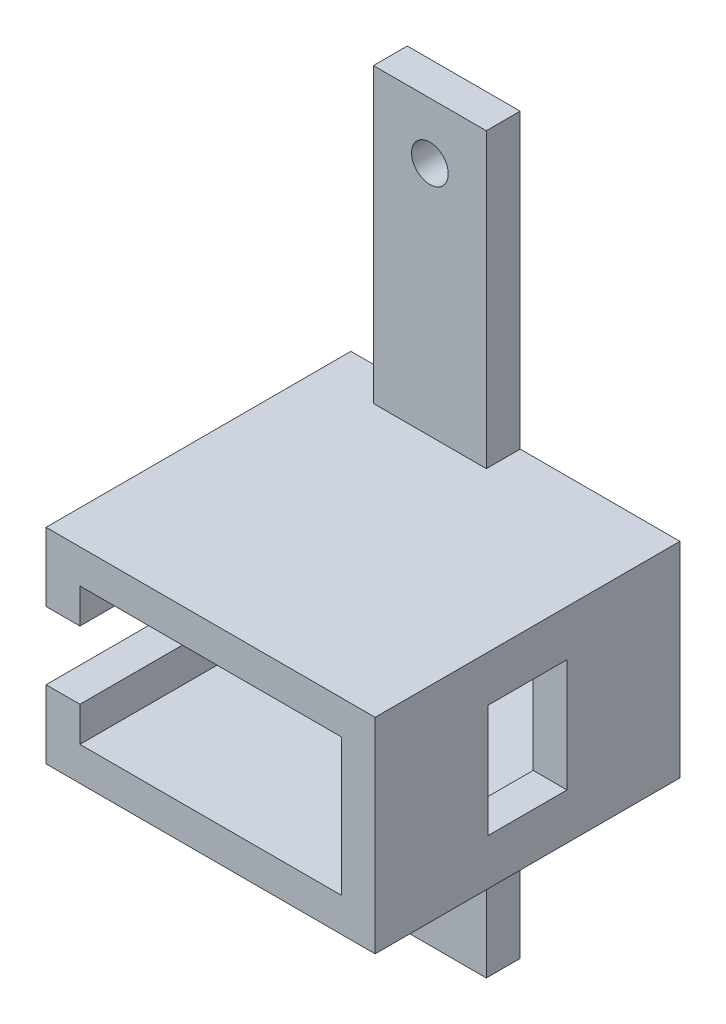
ISO-10303-21;
HEADER;
FILE_DESCRIPTION(('STEP AP214'),'2;1');
FILE_NAME('part.step','',(''),(''),'','','');
FILE_SCHEMA(('AUTOMOTIVE_DESIGN { 1 0 10303 214 1 1 1 1 }'));
ENDSEC;
DATA;
#1=APPLICATION_CONTEXT('core data for automotive mechanical design processes');
#2=APPLICATION_PROTOCOL_DEFINITION('international standard','automotive_design',2000,#1);
#3=PRODUCT_CONTEXT('',#1,'mechanical');
#4=PRODUCT('Part','Part','',(#3));
#5=PRODUCT_RELATED_PRODUCT_CATEGORY('part','',(#4));
#6=PRODUCT_DEFINITION_FORMATION('','',#4);
#7=PRODUCT_DEFINITION_CONTEXT('part definition',#1,'design');
#8=PRODUCT_DEFINITION('design','',#6,#7);
#9=PRODUCT_DEFINITION_SHAPE('','',#8);
#10=(LENGTH_UNIT() NAMED_UNIT(*) SI_UNIT(.MILLI.,.METRE.));
#11=(NAMED_UNIT(*) PLANE_ANGLE_UNIT() SI_UNIT($,.RADIAN.));
#12=(NAMED_UNIT(*) SI_UNIT($,.STERADIAN.) SOLID_ANGLE_UNIT());
#13=UNCERTAINTY_MEASURE_WITH_UNIT(LENGTH_MEASURE(1.E-05),#10,'distance_accuracy_value','');
#14=(GEOMETRIC_REPRESENTATION_CONTEXT(3) GLOBAL_UNCERTAINTY_ASSIGNED_CONTEXT((#13)) GLOBAL_UNIT_ASSIGNED_CONTEXT((#10,
#11,#12)) REPRESENTATION_CONTEXT('',''));
#15=CARTESIAN_POINT('',(0.,0.,0.));
#16=DIRECTION('',(0.,0.,1.));
#17=DIRECTION('',(1.,0.,0.));
#18=AXIS2_PLACEMENT_3D('',#15,#16,#17);
#19=CARTESIAN_POINT('',(-2.,0.,27.));
#20=DIRECTION('',(1.,0.,0.));
#21=DIRECTION('',(0.,1.,0.));
#22=AXIS2_PLACEMENT_3D('',#19,#20,#21);
#23=PLANE('',#22);
#24=DIRECTION('',(0.,0.,1.));
#25=VECTOR('',#24,1.);
#26=CARTESIAN_POINT('',(-2.,-32.,27.));
#27=LINE('',#26,#25);
#28=CARTESIAN_POINT('',(-2.,-32.,0.));
#29=VERTEX_POINT('',#28);
#30=CARTESIAN_POINT('',(-2.,-32.,27.));
#31=VERTEX_POINT('',#30);
#32=EDGE_CURVE('E233',#29,#31,#27,.T.);
#33=ORIENTED_EDGE('',*,*,#32,.F.);
#34=DIRECTION('',(0.,-1.,0.));
#35=VECTOR('',#34,1.);
#36=CARTESIAN_POINT('',(-2.,0.,0.));
#37=LINE('',#36,#35);
#38=CARTESIAN_POINT('',(-2.,-28.925,0.));
#39=VERTEX_POINT('',#38);
#40=EDGE_CURVE('E317',#39,#29,#37,.T.);
#41=ORIENTED_EDGE('',*,*,#40,.F.);
#42=DIRECTION('',(0.,0.,-1.));
#43=VECTOR('',#42,1.);
#44=CARTESIAN_POINT('',(-2.,-28.925,27.));
#45=LINE('',#44,#43);
#46=CARTESIAN_POINT('',(-2.,-28.925,27.));
#47=VERTEX_POINT('',#46);
#48=EDGE_CURVE('E337',#47,#39,#45,.T.);
#49=ORIENTED_EDGE('',*,*,#48,.F.);
#50=DIRECTION('',(0.,-1.,0.));
#51=VECTOR('',#50,1.);
#52=CARTESIAN_POINT('',(-2.,0.,27.));
#53=LINE('',#52,#51);
#54=EDGE_CURVE('E289',#47,#31,#53,.T.);
#55=ORIENTED_EDGE('',*,*,#54,.T.);
#56=EDGE_LOOP('',(#33,#41,#49,#55));
#57=FACE_BOUND('',#56,.T.);
#58=ADVANCED_FACE('F35',(#57),#23,.T.);
#59=CARTESIAN_POINT('',(-5.,0.,27.));
#60=DIRECTION('',(1.,0.,0.));
#61=DIRECTION('',(0.,1.,0.));
#62=AXIS2_PLACEMENT_3D('',#59,#60,#61);
#63=PLANE('',#62);
#64=DIRECTION('',(0.,-1.,0.));
#65=VECTOR('',#64,1.);
#66=CARTESIAN_POINT('',(-5.,0.,0.));
#67=LINE('',#66,#65);
#68=CARTESIAN_POINT('',(-4.99999999999999,-25.925,0.));
#69=VERTEX_POINT('',#68);
#70=CARTESIAN_POINT('',(-4.99999999999999,-32.,0.));
#71=VERTEX_POINT('',#70);
#72=EDGE_CURVE('E313',#69,#71,#67,.T.);
#73=ORIENTED_EDGE('',*,*,#72,.T.);
#74=DIRECTION('',(0.,0.,-1.));
#75=VECTOR('',#74,1.);
#76=CARTESIAN_POINT('',(-4.99999999999999,-32.,0.));
#77=LINE('',#76,#75);
#78=CARTESIAN_POINT('',(-4.99999999999999,-32.,27.));
#79=VERTEX_POINT('',#78);
#80=EDGE_CURVE('E224',#79,#71,#77,.T.);
#81=ORIENTED_EDGE('',*,*,#80,.F.);
#82=DIRECTION('',(0.,-1.,0.));
#83=VECTOR('',#82,1.);
#84=CARTESIAN_POINT('',(-5.,0.,27.));
#85=LINE('',#84,#83);
#86=CARTESIAN_POINT('',(-4.99999999999999,-25.925,27.));
#87=VERTEX_POINT('',#86);
#88=EDGE_CURVE('E285',#87,#79,#85,.T.);
#89=ORIENTED_EDGE('',*,*,#88,.F.);
#90=DIRECTION('',(0.,0.,-1.));
#91=VECTOR('',#90,1.);
#92=CARTESIAN_POINT('',(-4.99999999999999,-25.925,27.));
#93=LINE('',#92,#91);
#94=EDGE_CURVE('E342',#87,#69,#93,.T.);
#95=ORIENTED_EDGE('',*,*,#94,.T.);
#96=EDGE_LOOP('',(#73,#81,#89,#95));
#97=FACE_BOUND('',#96,.T.);
#98=ADVANCED_FACE('F419',(#97),#63,.F.);
#99=CARTESIAN_POINT('',(0.,0.,3.));
#100=DIRECTION('',(1.,0.,0.));
#101=DIRECTION('',(0.,1.,0.));
#102=AXIS2_PLACEMENT_3D('',#99,#100,#101);
#103=PLANE('',#102);
#104=DIRECTION('',(0.,-1.,0.));
#105=VECTOR('',#104,1.);
#106=CARTESIAN_POINT('',(0.,0.,0.));
#107=LINE('',#106,#105);
#108=CARTESIAN_POINT('',(0.,0.,0.));
#109=VERTEX_POINT('',#108);
#110=CARTESIAN_POINT('',(0.,-25.925,0.));
#111=VERTEX_POINT('',#110);
#112=EDGE_CURVE('E339',#109,#111,#107,.T.);
#113=ORIENTED_EDGE('',*,*,#112,.T.);
#114=DIRECTION('',(0.,0.,-1.));
#115=VECTOR('',#114,1.);
#116=CARTESIAN_POINT('',(0.,-25.925,3.));
#117=LINE('',#116,#115);
#118=CARTESIAN_POINT('',(0.,-25.925,3.));
#119=VERTEX_POINT('',#118);
#120=EDGE_CURVE('E371',#119,#111,#117,.T.);
#121=ORIENTED_EDGE('',*,*,#120,.F.);
#122=DIRECTION('',(0.,-1.,0.));
#123=VECTOR('',#122,1.);
#124=CARTESIAN_POINT('',(0.,0.,3.));
#125=LINE('',#124,#123);
#126=CARTESIAN_POINT('',(0.,0.,3.));
#127=VERTEX_POINT('',#126);
#128=EDGE_CURVE('E348',#127,#119,#125,.T.);
#129=ORIENTED_EDGE('',*,*,#128,.F.);
#130=DIRECTION('',(0.,0.,-1.));
#131=VECTOR('',#130,1.);
#132=CARTESIAN_POINT('',(0.,0.,3.));
#133=LINE('',#132,#131);
#134=EDGE_CURVE('E359',#127,#109,#133,.T.);
#135=ORIENTED_EDGE('',*,*,#134,.T.);
#136=EDGE_LOOP('',(#113,#121,#129,#135));
#137=FACE_BOUND('',#136,.T.);
#138=ADVANCED_FACE('F37',(#137),#103,.F.);
#139=CARTESIAN_POINT('',(10.,0.,3.));
#140=DIRECTION('',(1.,0.,0.));
#141=DIRECTION('',(0.,1.,0.));
#142=AXIS2_PLACEMENT_3D('',#139,#140,#141);
#143=PLANE('',#142);
#144=DIRECTION('',(0.,-1.,0.));
#145=VECTOR('',#144,1.);
#146=CARTESIAN_POINT('',(10.,0.,0.));
#147=LINE('',#146,#145);
#148=CARTESIAN_POINT('',(10.,0.,0.));
#149=VERTEX_POINT('',#148);
#150=CARTESIAN_POINT('',(10.,-25.925,0.));
#151=VERTEX_POINT('',#150);
#152=EDGE_CURVE('E361',#149,#151,#147,.T.);
#153=ORIENTED_EDGE('',*,*,#152,.F.);
#154=DIRECTION('',(0.,0.,-1.));
#155=VECTOR('',#154,1.);
#156=CARTESIAN_POINT('',(10.,0.,3.));
#157=LINE('',#156,#155);
#158=CARTESIAN_POINT('',(10.,0.,3.));
#159=VERTEX_POINT('',#158);
#160=EDGE_CURVE('E367',#159,#149,#157,.T.);
#161=ORIENTED_EDGE('',*,*,#160,.F.);
#162=DIRECTION('',(0.,-1.,0.));
#163=VECTOR('',#162,1.);
#164=CARTESIAN_POINT('',(10.,0.,3.));
#165=LINE('',#164,#163);
#166=CARTESIAN_POINT('',(10.,-25.925,3.));
#167=VERTEX_POINT('',#166);
#168=EDGE_CURVE('E353',#159,#167,#165,.T.);
#169=ORIENTED_EDGE('',*,*,#168,.T.);
#170=DIRECTION('',(0.,0.,-1.));
#171=VECTOR('',#170,1.);
#172=CARTESIAN_POINT('',(10.,-25.925,3.));
#173=LINE('',#172,#171);
#174=EDGE_CURVE('E369',#167,#151,#173,.T.);
#175=ORIENTED_EDGE('',*,*,#174,.T.);
#176=EDGE_LOOP('',(#153,#161,#169,#175));
#177=FACE_BOUND('',#176,.T.);
#178=ADVANCED_FACE('F461',(#177),#143,.T.);
#179=CARTESIAN_POINT('',(0.,0.,3.));
#180=DIRECTION('',(0.,1.,0.));
#181=DIRECTION('',(0.,0.,1.));
#182=AXIS2_PLACEMENT_3D('',#179,#180,#181);
#183=PLANE('',#182);
#184=DIRECTION('',(1.,0.,0.));
#185=VECTOR('',#184,1.);
#186=CARTESIAN_POINT('',(0.,0.,0.));
#187=LINE('',#186,#185);
#188=EDGE_CURVE('E351',#109,#149,#187,.T.);
#189=ORIENTED_EDGE('',*,*,#188,.F.);
#190=ORIENTED_EDGE('',*,*,#134,.F.);
#191=DIRECTION('',(1.,0.,0.));
#192=VECTOR('',#191,1.);
#193=CARTESIAN_POINT('',(0.,0.,3.));
#194=LINE('',#193,#192);
#195=EDGE_CURVE('E356',#127,#159,#194,.T.);
#196=ORIENTED_EDGE('',*,*,#195,.T.);
#197=ORIENTED_EDGE('',*,*,#160,.T.);
#198=EDGE_LOOP('',(#189,#190,#196,#197));
#199=FACE_BOUND('',#198,.T.);
#200=ADVANCED_FACE('F455',(#199),#183,.T.);
#201=CARTESIAN_POINT('',(0.,0.,3.));
#202=DIRECTION('',(0.,0.,1.));
#203=DIRECTION('',(1.,0.,0.));
#204=AXIS2_PLACEMENT_3D('',#201,#202,#203);
#205=PLANE('',#204);
#206=CARTESIAN_POINT('',(5.,-5.,3.));
#207=DIRECTION('',(0.,0.,1.));
#208=DIRECTION('',(1.,0.,0.));
#209=AXIS2_PLACEMENT_3D('',#206,#207,#208);
#210=CIRCLE('',#209,1.625);
#211=CARTESIAN_POINT('',(6.625,-5.,3.));
#212=VERTEX_POINT('',#211);
#213=EDGE_CURVE('E239',#212,#212,#210,.T.);
#214=ORIENTED_EDGE('',*,*,#213,.F.);
#215=EDGE_LOOP('',(#214));
#216=FACE_BOUND('',#215,.T.);
#217=ORIENTED_EDGE('',*,*,#128,.T.);
#218=DIRECTION('',(1.,0.,0.));
#219=VECTOR('',#218,1.);
#220=CARTESIAN_POINT('',(0.,-25.925,3.));
#221=LINE('',#220,#219);
#222=EDGE_CURVE('E350',#119,#167,#221,.T.);
#223=ORIENTED_EDGE('',*,*,#222,.T.);
#224=ORIENTED_EDGE('',*,*,#168,.F.);
#225=ORIENTED_EDGE('',*,*,#195,.F.);
#226=EDGE_LOOP('',(#217,#223,#224,#225));
#227=FACE_BOUND('',#226,.T.);
#228=ADVANCED_FACE('F449',(#216,#227),#205,.T.);
#229=CARTESIAN_POINT('',(0.,0.,0.));
#230=DIRECTION('',(0.,0.,1.));
#231=DIRECTION('',(1.,0.,0.));
#232=AXIS2_PLACEMENT_3D('',#229,#230,#231);
#233=PLANE('',#232);
#234=CARTESIAN_POINT('',(5.00000000000001,-60.,0.));
#235=DIRECTION('',(0.,0.,1.));
#236=DIRECTION('',(1.,0.,0.));
#237=AXIS2_PLACEMENT_3D('',#234,#235,#236);
#238=CIRCLE('',#237,1.625);
#239=CARTESIAN_POINT('',(6.62500000000001,-60.,0.));
#240=VERTEX_POINT('',#239);
#241=EDGE_CURVE('E236',#240,#240,#238,.T.);
#242=ORIENTED_EDGE('',*,*,#241,.T.);
#243=EDGE_LOOP('',(#242));
#244=FACE_BOUND('',#243,.T.);
#245=CARTESIAN_POINT('',(5.,-5.,0.));
#246=DIRECTION('',(0.,0.,1.));
#247=DIRECTION('',(1.,0.,0.));
#248=AXIS2_PLACEMENT_3D('',#245,#246,#247);
#249=CIRCLE('',#248,1.625);
#250=CARTESIAN_POINT('',(6.625,-5.,0.));
#251=VERTEX_POINT('',#250);
#252=EDGE_CURVE('E242',#251,#251,#249,.T.);
#253=ORIENTED_EDGE('',*,*,#252,.T.);
#254=EDGE_LOOP('',(#253));
#255=FACE_BOUND('',#254,.T.);
#256=ORIENTED_EDGE('',*,*,#40,.T.);
#257=DIRECTION('',(-1.,0.,0.));
#258=VECTOR('',#257,1.);
#259=CARTESIAN_POINT('',(5.00000000000001,-32.,0.));
#260=LINE('',#259,#258);
#261=EDGE_CURVE('E227',#29,#71,#260,.T.);
#262=ORIENTED_EDGE('',*,*,#261,.T.);
#263=ORIENTED_EDGE('',*,*,#72,.F.);
#264=DIRECTION('',(-1.,0.,0.));
#265=VECTOR('',#264,1.);
#266=CARTESIAN_POINT('',(0.,-25.925,0.));
#267=LINE('',#266,#265);
#268=EDGE_CURVE('E308',#111,#69,#267,.T.);
#269=ORIENTED_EDGE('',*,*,#268,.F.);
#270=ORIENTED_EDGE('',*,*,#112,.F.);
#271=ORIENTED_EDGE('',*,*,#188,.T.);
#272=ORIENTED_EDGE('',*,*,#152,.T.);
#273=CARTESIAN_POINT('',(24.15,-25.925,0.));
#274=VERTEX_POINT('',#273);
#275=EDGE_CURVE('E309',#274,#151,#267,.T.);
#276=ORIENTED_EDGE('',*,*,#275,.F.);
#277=DIRECTION('',(0.,-1.,0.));
#278=VECTOR('',#277,1.);
#279=CARTESIAN_POINT('',(24.15,0.,0.));
#280=LINE('',#279,#278);
#281=CARTESIAN_POINT('',(24.15,-44.075,0.));
#282=VERTEX_POINT('',#281);
#283=EDGE_CURVE('E305',#274,#282,#280,.T.);
#284=ORIENTED_EDGE('',*,*,#283,.T.);
#285=DIRECTION('',(-1.,0.,0.));
#286=VECTOR('',#285,1.);
#287=CARTESIAN_POINT('',(0.,-44.075,0.));
#288=LINE('',#287,#286);
#289=CARTESIAN_POINT('',(10.,-44.075,0.));
#290=VERTEX_POINT('',#289);
#291=EDGE_CURVE('E302',#282,#290,#288,.T.);
#292=ORIENTED_EDGE('',*,*,#291,.T.);
#293=DIRECTION('',(0.,-1.,0.));
#294=VECTOR('',#293,1.);
#295=CARTESIAN_POINT('',(10.,0.,0.));
#296=LINE('',#295,#294);
#297=CARTESIAN_POINT('',(10.,-65.,0.));
#298=VERTEX_POINT('',#297);
#299=EDGE_CURVE('E245',#290,#298,#296,.T.);
#300=ORIENTED_EDGE('',*,*,#299,.T.);
#301=DIRECTION('',(1.,0.,0.));
#302=VECTOR('',#301,1.);
#303=CARTESIAN_POINT('',(0.,-65.,0.));
#304=LINE('',#303,#302);
#305=CARTESIAN_POINT('',(0.,-65.,0.));
#306=VERTEX_POINT('',#305);
#307=EDGE_CURVE('E252',#306,#298,#304,.T.);
#308=ORIENTED_EDGE('',*,*,#307,.F.);
#309=DIRECTION('',(0.,-1.,0.));
#310=VECTOR('',#309,1.);
#311=CARTESIAN_POINT('',(0.,0.,0.));
#312=LINE('',#311,#310);
#313=CARTESIAN_POINT('',(0.,-44.075,0.));
#314=VERTEX_POINT('',#313);
#315=EDGE_CURVE('E261',#314,#306,#312,.T.);
#316=ORIENTED_EDGE('',*,*,#315,.F.);
#317=CARTESIAN_POINT('',(-4.99999999999999,-44.075,0.));
#318=VERTEX_POINT('',#317);
#319=EDGE_CURVE('E274',#314,#318,#288,.T.);
#320=ORIENTED_EDGE('',*,*,#319,.T.);
#321=CARTESIAN_POINT('',(-4.99999999999999,-38.,0.));
#322=VERTEX_POINT('',#321);
#323=EDGE_CURVE('E312',#322,#318,#67,.T.);
#324=ORIENTED_EDGE('',*,*,#323,.F.);
#325=DIRECTION('',(-1.,0.,0.));
#326=VECTOR('',#325,1.);
#327=CARTESIAN_POINT('',(5.00000000000001,-38.,0.));
#328=LINE('',#327,#326);
#329=CARTESIAN_POINT('',(-1.99999999999999,-38.,0.));
#330=VERTEX_POINT('',#329);
#331=EDGE_CURVE('E226',#330,#322,#328,.T.);
#332=ORIENTED_EDGE('',*,*,#331,.F.);
#333=CARTESIAN_POINT('',(-1.99999999999999,-41.075,0.));
#334=VERTEX_POINT('',#333);
#335=EDGE_CURVE('E316',#330,#334,#37,.T.);
#336=ORIENTED_EDGE('',*,*,#335,.T.);
#337=DIRECTION('',(-1.,0.,0.));
#338=VECTOR('',#337,1.);
#339=CARTESIAN_POINT('',(0.,-41.075,0.));
#340=LINE('',#339,#338);
#341=CARTESIAN_POINT('',(21.15,-41.075,0.));
#342=VERTEX_POINT('',#341);
#343=EDGE_CURVE('E279',#342,#334,#340,.T.);
#344=ORIENTED_EDGE('',*,*,#343,.F.);
#345=DIRECTION('',(0.,-1.,0.));
#346=VECTOR('',#345,1.);
#347=CARTESIAN_POINT('',(21.15,0.,0.));
#348=LINE('',#347,#346);
#349=CARTESIAN_POINT('',(21.15,-28.925,0.));
#350=VERTEX_POINT('',#349);
#351=EDGE_CURVE('E323',#350,#342,#348,.T.);
#352=ORIENTED_EDGE('',*,*,#351,.F.);
#353=DIRECTION('',(-1.,0.,0.));
#354=VECTOR('',#353,1.);
#355=CARTESIAN_POINT('',(0.,-28.925,0.));
#356=LINE('',#355,#354);
#357=EDGE_CURVE('E320',#350,#39,#356,.T.);
#358=ORIENTED_EDGE('',*,*,#357,.T.);
#359=EDGE_LOOP('',(#256,#262,#263,#269,#270,#271,#272,#276,#284,#292,#300,#308,#316,#320,#324,
#332,#336,#344,#352,#358));
#360=FACE_BOUND('',#359,.T.);
#361=ADVANCED_FACE('F395',(#244,#255,#360),#233,.F.);
#362=DIRECTION('',(0.,0.,-1.));
#363=VECTOR('',#362,1.);
#364=CARTESIAN_POINT('',(-1.99999999999999,-38.,27.));
#365=LINE('',#364,#363);
#366=CARTESIAN_POINT('',(-1.99999999999999,-38.,27.));
#367=VERTEX_POINT('',#366);
#368=EDGE_CURVE('E230',#367,#330,#365,.T.);
#369=ORIENTED_EDGE('',*,*,#368,.F.);
#370=CARTESIAN_POINT('',(-1.99999999999999,-41.075,27.));
#371=VERTEX_POINT('',#370);
#372=EDGE_CURVE('E288',#367,#371,#53,.T.);
#373=ORIENTED_EDGE('',*,*,#372,.T.);
#374=DIRECTION('',(0.,0.,-1.));
#375=VECTOR('',#374,1.);
#376=CARTESIAN_POINT('',(-1.99999999999999,-41.075,27.));
#377=LINE('',#376,#375);
#378=EDGE_CURVE('E328',#371,#334,#377,.T.);
#379=ORIENTED_EDGE('',*,*,#378,.T.);
#380=ORIENTED_EDGE('',*,*,#335,.F.);
#381=EDGE_LOOP('',(#369,#373,#379,#380));
#382=FACE_BOUND('',#381,.T.);
#383=ADVANCED_FACE('F384',(#382),#23,.T.);
#384=CARTESIAN_POINT('',(0.,-28.925,27.));
#385=DIRECTION('',(0.,-1.,0.));
#386=DIRECTION('',(1.,0.,0.));
#387=AXIS2_PLACEMENT_3D('',#384,#385,#386);
#388=PLANE('',#387);
#389=ORIENTED_EDGE('',*,*,#357,.F.);
#390=DIRECTION('',(0.,0.,-1.));
#391=VECTOR('',#390,1.);
#392=CARTESIAN_POINT('',(21.15,-28.925,27.));
#393=LINE('',#392,#391);
#394=CARTESIAN_POINT('',(21.15,-28.925,27.));
#395=VERTEX_POINT('',#394);
#396=EDGE_CURVE('E335',#395,#350,#393,.T.);
#397=ORIENTED_EDGE('',*,*,#396,.F.);
#398=DIRECTION('',(-1.,0.,0.));
#399=VECTOR('',#398,1.);
#400=CARTESIAN_POINT('',(0.,-28.925,27.));
#401=LINE('',#400,#399);
#402=EDGE_CURVE('E292',#395,#47,#401,.T.);
#403=ORIENTED_EDGE('',*,*,#402,.T.);
#404=ORIENTED_EDGE('',*,*,#48,.T.);
#405=EDGE_LOOP('',(#389,#397,#403,#404));
#406=FACE_BOUND('',#405,.T.);
#407=ADVANCED_FACE('F428',(#406),#388,.T.);
#408=CARTESIAN_POINT('',(21.15,0.,27.));
#409=DIRECTION('',(1.,0.,0.));
#410=DIRECTION('',(0.,1.,0.));
#411=AXIS2_PLACEMENT_3D('',#408,#409,#410);
#412=PLANE('',#411);
#413=DIRECTION('',(0.,0.,-1.));
#414=VECTOR('',#413,1.);
#415=CARTESIAN_POINT('',(21.15,-30.,17.));
#416=LINE('',#415,#414);
#417=CARTESIAN_POINT('',(21.15,-30.,17.));
#418=VERTEX_POINT('',#417);
#419=CARTESIAN_POINT('',(21.15,-30.,10.));
#420=VERTEX_POINT('',#419);
#421=EDGE_CURVE('E199',#418,#420,#416,.T.);
#422=ORIENTED_EDGE('',*,*,#421,.F.);
#423=DIRECTION('',(0.,1.,0.));
#424=VECTOR('',#423,1.);
#425=CARTESIAN_POINT('',(21.15,-30.,17.));
#426=LINE('',#425,#424);
#427=CARTESIAN_POINT('',(21.15,-40.,17.));
#428=VERTEX_POINT('',#427);
#429=EDGE_CURVE('E206',#428,#418,#426,.T.);
#430=ORIENTED_EDGE('',*,*,#429,.F.);
#431=DIRECTION('',(0.,0.,1.));
#432=VECTOR('',#431,1.);
#433=CARTESIAN_POINT('',(21.15,-40.,17.));
#434=LINE('',#433,#432);
#435=CARTESIAN_POINT('',(21.15,-40.,10.));
#436=VERTEX_POINT('',#435);
#437=EDGE_CURVE('E211',#436,#428,#434,.T.);
#438=ORIENTED_EDGE('',*,*,#437,.F.);
#439=DIRECTION('',(0.,-1.,0.));
#440=VECTOR('',#439,1.);
#441=CARTESIAN_POINT('',(21.15,-30.,10.));
#442=LINE('',#441,#440);
#443=EDGE_CURVE('E50',#420,#436,#442,.T.);
#444=ORIENTED_EDGE('',*,*,#443,.F.);
#445=EDGE_LOOP('',(#422,#430,#438,#444));
#446=FACE_BOUND('',#445,.T.);
#447=ORIENTED_EDGE('',*,*,#351,.T.);
#448=DIRECTION('',(0.,0.,-1.));
#449=VECTOR('',#448,1.);
#450=CARTESIAN_POINT('',(21.15,-41.075,27.));
#451=LINE('',#450,#449);
#452=CARTESIAN_POINT('',(21.15,-41.075,27.));
#453=VERTEX_POINT('',#452);
#454=EDGE_CURVE('E331',#453,#342,#451,.T.);
#455=ORIENTED_EDGE('',*,*,#454,.F.);
#456=DIRECTION('',(0.,-1.,0.));
#457=VECTOR('',#456,1.);
#458=CARTESIAN_POINT('',(21.15,0.,27.));
#459=LINE('',#458,#457);
#460=EDGE_CURVE('E295',#395,#453,#459,.T.);
#461=ORIENTED_EDGE('',*,*,#460,.F.);
#462=ORIENTED_EDGE('',*,*,#396,.T.);
#463=EDGE_LOOP('',(#447,#455,#461,#462));
#464=FACE_BOUND('',#463,.T.);
#465=ADVANCED_FACE('F213',(#446,#464),#412,.F.);
#466=CARTESIAN_POINT('',(0.,-44.075,27.));
#467=DIRECTION('',(0.,-1.,0.));
#468=DIRECTION('',(1.,0.,0.));
#469=AXIS2_PLACEMENT_3D('',#466,#467,#468);
#470=PLANE('',#469);
#471=DIRECTION('',(0.,0.,-1.));
#472=VECTOR('',#471,1.);
#473=CARTESIAN_POINT('',(0.,-44.075,3.));
#474=LINE('',#473,#472);
#475=CARTESIAN_POINT('',(0.,-44.075,3.));
#476=VERTEX_POINT('',#475);
#477=EDGE_CURVE('E269',#476,#314,#474,.T.);
#478=ORIENTED_EDGE('',*,*,#477,.F.);
#479=DIRECTION('',(-1.,0.,0.));
#480=VECTOR('',#479,1.);
#481=CARTESIAN_POINT('',(0.,-44.075,3.));
#482=LINE('',#481,#480);
#483=CARTESIAN_POINT('',(10.,-44.075,3.));
#484=VERTEX_POINT('',#483);
#485=EDGE_CURVE('E251',#484,#476,#482,.T.);
#486=ORIENTED_EDGE('',*,*,#485,.F.);
#487=DIRECTION('',(0.,0.,-1.));
#488=VECTOR('',#487,1.);
#489=CARTESIAN_POINT('',(10.,-44.075,3.));
#490=LINE('',#489,#488);
#491=EDGE_CURVE('E271',#484,#290,#490,.T.);
#492=ORIENTED_EDGE('',*,*,#491,.T.);
#493=ORIENTED_EDGE('',*,*,#291,.F.);
#494=DIRECTION('',(0.,0.,-1.));
#495=VECTOR('',#494,1.);
#496=CARTESIAN_POINT('',(24.15,-44.075,27.));
#497=LINE('',#496,#495);
#498=CARTESIAN_POINT('',(24.15,-44.075,27.));
#499=VERTEX_POINT('',#498);
#500=EDGE_CURVE('E332',#499,#282,#497,.T.);
#501=ORIENTED_EDGE('',*,*,#500,.F.);
#502=DIRECTION('',(-1.,0.,0.));
#503=VECTOR('',#502,1.);
#504=CARTESIAN_POINT('',(0.,-44.075,27.));
#505=LINE('',#504,#503);
#506=CARTESIAN_POINT('',(-4.99999999999999,-44.075,27.));
#507=VERTEX_POINT('',#506);
#508=EDGE_CURVE('E275',#499,#507,#505,.T.);
#509=ORIENTED_EDGE('',*,*,#508,.T.);
#510=DIRECTION('',(0.,0.,-1.));
#511=VECTOR('',#510,1.);
#512=CARTESIAN_POINT('',(-4.99999999999999,-44.075,27.));
#513=LINE('',#512,#511);
#514=EDGE_CURVE('E301',#507,#318,#513,.T.);
#515=ORIENTED_EDGE('',*,*,#514,.T.);
#516=ORIENTED_EDGE('',*,*,#319,.F.);
#517=EDGE_LOOP('',(#478,#486,#492,#493,#501,#509,#515,#516));
#518=FACE_BOUND('',#517,.T.);
#519=ADVANCED_FACE('F430',(#518),#470,.T.);
#520=CARTESIAN_POINT('',(24.15,0.,27.));
#521=DIRECTION('',(1.,0.,0.));
#522=DIRECTION('',(0.,1.,0.));
#523=AXIS2_PLACEMENT_3D('',#520,#521,#522);
#524=PLANE('',#523);
#525=DIRECTION('',(0.,-1.,0.));
#526=VECTOR('',#525,1.);
#527=CARTESIAN_POINT('',(24.15,-30.,17.));
#528=LINE('',#527,#526);
#529=CARTESIAN_POINT('',(24.15,-30.,17.));
#530=VERTEX_POINT('',#529);
#531=CARTESIAN_POINT('',(24.15,-40.,17.));
#532=VERTEX_POINT('',#531);
#533=EDGE_CURVE('E58',#530,#532,#528,.T.);
#534=ORIENTED_EDGE('',*,*,#533,.F.);
#535=DIRECTION('',(0.,0.,1.));
#536=VECTOR('',#535,1.);
#537=CARTESIAN_POINT('',(24.15,-30.,17.));
#538=LINE('',#537,#536);
#539=CARTESIAN_POINT('',(24.15,-30.,10.));
#540=VERTEX_POINT('',#539);
#541=EDGE_CURVE('E201',#540,#530,#538,.T.);
#542=ORIENTED_EDGE('',*,*,#541,.F.);
#543=DIRECTION('',(0.,1.,0.));
#544=VECTOR('',#543,1.);
#545=CARTESIAN_POINT('',(24.15,-30.,10.));
#546=LINE('',#545,#544);
#547=CARTESIAN_POINT('',(24.15,-40.,10.));
#548=VERTEX_POINT('',#547);
#549=EDGE_CURVE('E524',#548,#540,#546,.T.);
#550=ORIENTED_EDGE('',*,*,#549,.F.);
#551=DIRECTION('',(0.,0.,-1.));
#552=VECTOR('',#551,1.);
#553=CARTESIAN_POINT('',(24.15,-40.,17.));
#554=LINE('',#553,#552);
#555=EDGE_CURVE('E523',#532,#548,#554,.T.);
#556=ORIENTED_EDGE('',*,*,#555,.F.);
#557=EDGE_LOOP('',(#534,#542,#550,#556));
#558=FACE_BOUND('',#557,.T.);
#559=ORIENTED_EDGE('',*,*,#283,.F.);
#560=DIRECTION('',(0.,0.,-1.));
#561=VECTOR('',#560,1.);
#562=CARTESIAN_POINT('',(24.15,-25.925,27.));
#563=LINE('',#562,#561);
#564=CARTESIAN_POINT('',(24.15,-25.925,27.));
#565=VERTEX_POINT('',#564);
#566=EDGE_CURVE('E345',#565,#274,#563,.T.);
#567=ORIENTED_EDGE('',*,*,#566,.F.);
#568=DIRECTION('',(0.,-1.,0.));
#569=VECTOR('',#568,1.);
#570=CARTESIAN_POINT('',(24.15,0.,27.));
#571=LINE('',#570,#569);
#572=EDGE_CURVE('E278',#565,#499,#571,.T.);
#573=ORIENTED_EDGE('',*,*,#572,.T.);
#574=ORIENTED_EDGE('',*,*,#500,.T.);
#575=EDGE_LOOP('',(#559,#567,#573,#574));
#576=FACE_BOUND('',#575,.T.);
#577=ADVANCED_FACE('F407',(#558,#576),#524,.T.);
#578=CARTESIAN_POINT('',(0.,-25.925,27.));
#579=DIRECTION('',(0.,-1.,0.));
#580=DIRECTION('',(0.,0.,-1.));
#581=AXIS2_PLACEMENT_3D('',#578,#579,#580);
#582=PLANE('',#581);
#583=ORIENTED_EDGE('',*,*,#174,.F.);
#584=ORIENTED_EDGE('',*,*,#222,.F.);
#585=ORIENTED_EDGE('',*,*,#120,.T.);
#586=ORIENTED_EDGE('',*,*,#268,.T.);
#587=ORIENTED_EDGE('',*,*,#94,.F.);
#588=DIRECTION('',(-1.,0.,0.));
#589=VECTOR('',#588,1.);
#590=CARTESIAN_POINT('',(0.,-25.925,27.));
#591=LINE('',#590,#589);
#592=EDGE_CURVE('E282',#565,#87,#591,.T.);
#593=ORIENTED_EDGE('',*,*,#592,.F.);
#594=ORIENTED_EDGE('',*,*,#566,.T.);
#595=ORIENTED_EDGE('',*,*,#275,.T.);
#596=EDGE_LOOP('',(#583,#584,#585,#586,#587,#593,#594,#595));
#597=FACE_BOUND('',#596,.T.);
#598=ADVANCED_FACE('F414',(#597),#582,.F.);
#599=CARTESIAN_POINT('',(-4.99999999999999,-38.,27.));
#600=VERTEX_POINT('',#599);
#601=EDGE_CURVE('E284',#600,#507,#85,.T.);
#602=ORIENTED_EDGE('',*,*,#601,.F.);
#603=DIRECTION('',(0.,0.,1.));
#604=VECTOR('',#603,1.);
#605=CARTESIAN_POINT('',(-4.99999999999999,-38.,0.));
#606=LINE('',#605,#604);
#607=EDGE_CURVE('E216',#322,#600,#606,.T.);
#608=ORIENTED_EDGE('',*,*,#607,.F.);
#609=ORIENTED_EDGE('',*,*,#323,.T.);
#610=ORIENTED_EDGE('',*,*,#514,.F.);
#611=EDGE_LOOP('',(#602,#608,#609,#610));
#612=FACE_BOUND('',#611,.T.);
#613=ADVANCED_FACE('F400',(#612),#63,.F.);
#614=CARTESIAN_POINT('',(0.,-41.075,27.));
#615=DIRECTION('',(0.,-1.,0.));
#616=DIRECTION('',(0.,0.,-1.));
#617=AXIS2_PLACEMENT_3D('',#614,#615,#616);
#618=PLANE('',#617);
#619=ORIENTED_EDGE('',*,*,#343,.T.);
#620=ORIENTED_EDGE('',*,*,#378,.F.);
#621=DIRECTION('',(-1.,0.,0.));
#622=VECTOR('',#621,1.);
#623=CARTESIAN_POINT('',(0.,-41.075,27.));
#624=LINE('',#623,#622);
#625=EDGE_CURVE('E298',#453,#371,#624,.T.);
#626=ORIENTED_EDGE('',*,*,#625,.F.);
#627=ORIENTED_EDGE('',*,*,#454,.T.);
#628=EDGE_LOOP('',(#619,#620,#626,#627));
#629=FACE_BOUND('',#628,.T.);
#630=ADVANCED_FACE('F392',(#629),#618,.F.);
#631=CARTESIAN_POINT('',(0.,0.,27.));
#632=DIRECTION('',(0.,0.,1.));
#633=DIRECTION('',(1.,0.,0.));
#634=AXIS2_PLACEMENT_3D('',#631,#632,#633);
#635=PLANE('',#634);
#636=DIRECTION('',(-1.,0.,0.));
#637=VECTOR('',#636,1.);
#638=CARTESIAN_POINT('',(0.,-32.,27.));
#639=LINE('',#638,#637);
#640=EDGE_CURVE('E11',#31,#79,#639,.T.);
#641=ORIENTED_EDGE('',*,*,#640,.F.);
#642=ORIENTED_EDGE('',*,*,#54,.F.);
#643=ORIENTED_EDGE('',*,*,#402,.F.);
#644=ORIENTED_EDGE('',*,*,#460,.T.);
#645=ORIENTED_EDGE('',*,*,#625,.T.);
#646=ORIENTED_EDGE('',*,*,#372,.F.);
#647=DIRECTION('',(1.,0.,0.));
#648=VECTOR('',#647,1.);
#649=CARTESIAN_POINT('',(0.,-38.,27.));
#650=LINE('',#649,#648);
#651=EDGE_CURVE('E43',#600,#367,#650,.T.);
#652=ORIENTED_EDGE('',*,*,#651,.F.);
#653=ORIENTED_EDGE('',*,*,#601,.T.);
#654=ORIENTED_EDGE('',*,*,#508,.F.);
#655=ORIENTED_EDGE('',*,*,#572,.F.);
#656=ORIENTED_EDGE('',*,*,#592,.T.);
#657=ORIENTED_EDGE('',*,*,#88,.T.);
#658=EDGE_LOOP('',(#641,#642,#643,#644,#645,#646,#652,#653,#654,#655,#656,#657));
#659=FACE_BOUND('',#658,.T.);
#660=ADVANCED_FACE('F386',(#659),#635,.T.);
#661=CARTESIAN_POINT('',(10.,0.,3.));
#662=DIRECTION('',(1.,0.,0.));
#663=DIRECTION('',(0.,1.,0.));
#664=AXIS2_PLACEMENT_3D('',#661,#662,#663);
#665=PLANE('',#664);
#666=ORIENTED_EDGE('',*,*,#299,.F.);
#667=ORIENTED_EDGE('',*,*,#491,.F.);
#668=DIRECTION('',(0.,-1.,0.));
#669=VECTOR('',#668,1.);
#670=CARTESIAN_POINT('',(10.,0.,3.));
#671=LINE('',#670,#669);
#672=CARTESIAN_POINT('',(10.,-65.,3.));
#673=VERTEX_POINT('',#672);
#674=EDGE_CURVE('E248',#484,#673,#671,.T.);
#675=ORIENTED_EDGE('',*,*,#674,.T.);
#676=DIRECTION('',(0.,0.,-1.));
#677=VECTOR('',#676,1.);
#678=CARTESIAN_POINT('',(10.,-65.,3.));
#679=LINE('',#678,#677);
#680=EDGE_CURVE('E258',#673,#298,#679,.T.);
#681=ORIENTED_EDGE('',*,*,#680,.T.);
#682=EDGE_LOOP('',(#666,#667,#675,#681));
#683=FACE_BOUND('',#682,.T.);
#684=ADVANCED_FACE('F483',(#683),#665,.T.);
#685=CARTESIAN_POINT('',(0.,0.,3.));
#686=DIRECTION('',(1.,0.,0.));
#687=DIRECTION('',(0.,1.,0.));
#688=AXIS2_PLACEMENT_3D('',#685,#686,#687);
#689=PLANE('',#688);
#690=ORIENTED_EDGE('',*,*,#315,.T.);
#691=DIRECTION('',(0.,0.,-1.));
#692=VECTOR('',#691,1.);
#693=CARTESIAN_POINT('',(0.,-65.,3.));
#694=LINE('',#693,#692);
#695=CARTESIAN_POINT('',(0.,-65.,3.));
#696=VERTEX_POINT('',#695);
#697=EDGE_CURVE('E266',#696,#306,#694,.T.);
#698=ORIENTED_EDGE('',*,*,#697,.F.);
#699=DIRECTION('',(0.,-1.,0.));
#700=VECTOR('',#699,1.);
#701=CARTESIAN_POINT('',(0.,0.,3.));
#702=LINE('',#701,#700);
#703=EDGE_CURVE('E254',#476,#696,#702,.T.);
#704=ORIENTED_EDGE('',*,*,#703,.F.);
#705=ORIENTED_EDGE('',*,*,#477,.T.);
#706=EDGE_LOOP('',(#690,#698,#704,#705));
#707=FACE_BOUND('',#706,.T.);
#708=ADVANCED_FACE('F495',(#707),#689,.F.);
#709=CARTESIAN_POINT('',(0.,-65.,3.));
#710=DIRECTION('',(0.,1.,0.));
#711=DIRECTION('',(0.,0.,1.));
#712=AXIS2_PLACEMENT_3D('',#709,#710,#711);
#713=PLANE('',#712);
#714=ORIENTED_EDGE('',*,*,#307,.T.);
#715=ORIENTED_EDGE('',*,*,#680,.F.);
#716=DIRECTION('',(1.,0.,0.));
#717=VECTOR('',#716,1.);
#718=CARTESIAN_POINT('',(0.,-65.,3.));
#719=LINE('',#718,#717);
#720=EDGE_CURVE('E256',#696,#673,#719,.T.);
#721=ORIENTED_EDGE('',*,*,#720,.F.);
#722=ORIENTED_EDGE('',*,*,#697,.T.);
#723=EDGE_LOOP('',(#714,#715,#721,#722));
#724=FACE_BOUND('',#723,.T.);
#725=ADVANCED_FACE('F491',(#724),#713,.F.);
#726=CARTESIAN_POINT('',(0.,0.,3.));
#727=DIRECTION('',(0.,0.,1.));
#728=DIRECTION('',(1.,0.,0.));
#729=AXIS2_PLACEMENT_3D('',#726,#727,#728);
#730=PLANE('',#729);
#731=CARTESIAN_POINT('',(5.00000000000001,-60.,3.));
#732=DIRECTION('',(0.,0.,1.));
#733=DIRECTION('',(1.,0.,0.));
#734=AXIS2_PLACEMENT_3D('',#731,#732,#733);
#735=CIRCLE('',#734,1.625);
#736=CARTESIAN_POINT('',(6.62500000000001,-60.,3.));
#737=VERTEX_POINT('',#736);
#738=EDGE_CURVE('E235',#737,#737,#735,.T.);
#739=ORIENTED_EDGE('',*,*,#738,.F.);
#740=EDGE_LOOP('',(#739));
#741=FACE_BOUND('',#740,.T.);
#742=ORIENTED_EDGE('',*,*,#674,.F.);
#743=ORIENTED_EDGE('',*,*,#485,.T.);
#744=ORIENTED_EDGE('',*,*,#703,.T.);
#745=ORIENTED_EDGE('',*,*,#720,.T.);
#746=EDGE_LOOP('',(#742,#743,#744,#745));
#747=FACE_BOUND('',#746,.T.);
#748=ADVANCED_FACE('F485',(#741,#747),#730,.T.);
#749=CARTESIAN_POINT('',(5.,-5.,0.));
#750=DIRECTION('',(0.,0.,1.));
#751=DIRECTION('',(1.,0.,0.));
#752=AXIS2_PLACEMENT_3D('',#749,#750,#751);
#753=CYLINDRICAL_SURFACE('',#752,1.625);
#754=ORIENTED_EDGE('',*,*,#252,.F.);
#755=EDGE_LOOP('',(#754));
#756=FACE_BOUND('',#755,.T.);
#757=ORIENTED_EDGE('',*,*,#213,.T.);
#758=EDGE_LOOP('',(#757));
#759=FACE_BOUND('',#758,.T.);
#760=ADVANCED_FACE('F551',(#756,#759),#753,.F.);
#761=CARTESIAN_POINT('',(5.00000000000001,-60.,0.));
#762=DIRECTION('',(0.,0.,1.));
#763=DIRECTION('',(1.,0.,0.));
#764=AXIS2_PLACEMENT_3D('',#761,#762,#763);
#765=CYLINDRICAL_SURFACE('',#764,1.625);
#766=ORIENTED_EDGE('',*,*,#241,.F.);
#767=EDGE_LOOP('',(#766));
#768=FACE_BOUND('',#767,.T.);
#769=ORIENTED_EDGE('',*,*,#738,.T.);
#770=EDGE_LOOP('',(#769));
#771=FACE_BOUND('',#770,.T.);
#772=ADVANCED_FACE('F548',(#768,#771),#765,.F.);
#773=CARTESIAN_POINT('',(5.00000000000001,-38.,0.));
#774=DIRECTION('',(0.,-1.,0.));
#775=DIRECTION('',(1.,0.,0.));
#776=AXIS2_PLACEMENT_3D('',#773,#774,#775);
#777=PLANE('',#776);
#778=ORIENTED_EDGE('',*,*,#368,.T.);
#779=ORIENTED_EDGE('',*,*,#331,.T.);
#780=ORIENTED_EDGE('',*,*,#607,.T.);
#781=ORIENTED_EDGE('',*,*,#651,.T.);
#782=EDGE_LOOP('',(#778,#779,#780,#781));
#783=FACE_BOUND('',#782,.T.);
#784=ADVANCED_FACE('F376',(#783),#777,.F.);
#785=CARTESIAN_POINT('',(5.00000000000001,-32.,0.));
#786=DIRECTION('',(0.,1.,0.));
#787=DIRECTION('',(-1.,0.,0.));
#788=AXIS2_PLACEMENT_3D('',#785,#786,#787);
#789=PLANE('',#788);
#790=ORIENTED_EDGE('',*,*,#32,.T.);
#791=ORIENTED_EDGE('',*,*,#640,.T.);
#792=ORIENTED_EDGE('',*,*,#80,.T.);
#793=ORIENTED_EDGE('',*,*,#261,.F.);
#794=EDGE_LOOP('',(#790,#791,#792,#793));
#795=FACE_BOUND('',#794,.T.);
#796=ADVANCED_FACE('F422',(#795),#789,.F.);
#797=CARTESIAN_POINT('',(-5.001,-30.,17.));
#798=DIRECTION('',(0.,0.,1.));
#799=DIRECTION('',(1.,0.,0.));
#800=AXIS2_PLACEMENT_3D('',#797,#798,#799);
#801=PLANE('',#800);
#802=ORIENTED_EDGE('',*,*,#429,.T.);
#803=DIRECTION('',(1.,0.,0.));
#804=VECTOR('',#803,1.);
#805=CARTESIAN_POINT('',(-5.001,-30.,17.));
#806=LINE('',#805,#804);
#807=EDGE_CURVE('E195',#418,#530,#806,.T.);
#808=ORIENTED_EDGE('',*,*,#807,.T.);
#809=ORIENTED_EDGE('',*,*,#533,.T.);
#810=DIRECTION('',(1.,0.,0.));
#811=VECTOR('',#810,1.);
#812=CARTESIAN_POINT('',(-5.001,-40.,17.));
#813=LINE('',#812,#811);
#814=EDGE_CURVE('E203',#428,#532,#813,.T.);
#815=ORIENTED_EDGE('',*,*,#814,.F.);
#816=EDGE_LOOP('',(#802,#808,#809,#815));
#817=FACE_BOUND('',#816,.T.);
#818=ADVANCED_FACE('F207',(#817),#801,.F.);
#819=CARTESIAN_POINT('',(-5.001,-30.,17.));
#820=DIRECTION('',(0.,1.,0.));
#821=DIRECTION('',(-1.,0.,0.));
#822=AXIS2_PLACEMENT_3D('',#819,#820,#821);
#823=PLANE('',#822);
#824=ORIENTED_EDGE('',*,*,#421,.T.);
#825=DIRECTION('',(1.,0.,0.));
#826=VECTOR('',#825,1.);
#827=CARTESIAN_POINT('',(-5.001,-30.,10.));
#828=LINE('',#827,#826);
#829=EDGE_CURVE('E202',#420,#540,#828,.T.);
#830=ORIENTED_EDGE('',*,*,#829,.T.);
#831=ORIENTED_EDGE('',*,*,#541,.T.);
#832=ORIENTED_EDGE('',*,*,#807,.F.);
#833=EDGE_LOOP('',(#824,#830,#831,#832));
#834=FACE_BOUND('',#833,.T.);
#835=ADVANCED_FACE('F197',(#834),#823,.F.);
#836=CARTESIAN_POINT('',(-5.001,-30.,10.));
#837=DIRECTION('',(0.,0.,-1.));
#838=DIRECTION('',(-1.,0.,0.));
#839=AXIS2_PLACEMENT_3D('',#836,#837,#838);
#840=PLANE('',#839);
#841=ORIENTED_EDGE('',*,*,#443,.T.);
#842=DIRECTION('',(1.,0.,0.));
#843=VECTOR('',#842,1.);
#844=CARTESIAN_POINT('',(-5.001,-40.,10.));
#845=LINE('',#844,#843);
#846=EDGE_CURVE('E220',#436,#548,#845,.T.);
#847=ORIENTED_EDGE('',*,*,#846,.T.);
#848=ORIENTED_EDGE('',*,*,#549,.T.);
#849=ORIENTED_EDGE('',*,*,#829,.F.);
#850=EDGE_LOOP('',(#841,#847,#848,#849));
#851=FACE_BOUND('',#850,.T.);
#852=ADVANCED_FACE('F533',(#851),#840,.F.);
#853=CARTESIAN_POINT('',(-5.001,-40.,17.));
#854=DIRECTION('',(0.,-1.,0.));
#855=DIRECTION('',(0.,0.,-1.));
#856=AXIS2_PLACEMENT_3D('',#853,#854,#855);
#857=PLANE('',#856);
#858=ORIENTED_EDGE('',*,*,#437,.T.);
#859=ORIENTED_EDGE('',*,*,#814,.T.);
#860=ORIENTED_EDGE('',*,*,#555,.T.);
#861=ORIENTED_EDGE('',*,*,#846,.F.);
#862=EDGE_LOOP('',(#858,#859,#860,#861));
#863=FACE_BOUND('',#862,.T.);
#864=ADVANCED_FACE('F532',(#863),#857,.F.);
#865=CLOSED_SHELL('',(#58,#98,#138,#178,#200,#228,#361,#383,#407,#465,#519,#577,#598,#613,#630,
#660,#684,#708,#725,#748,#760,#772,#784,#796,#818,#835,#852,#864));
#866=MANIFOLD_SOLID_BREP('B2',#865);
#867=ADVANCED_BREP_SHAPE_REPRESENTATION('',(#18,#866),#14);
#868=SHAPE_DEFINITION_REPRESENTATION(#9,#867);
ENDSEC;
END-ISO-10303-21;
